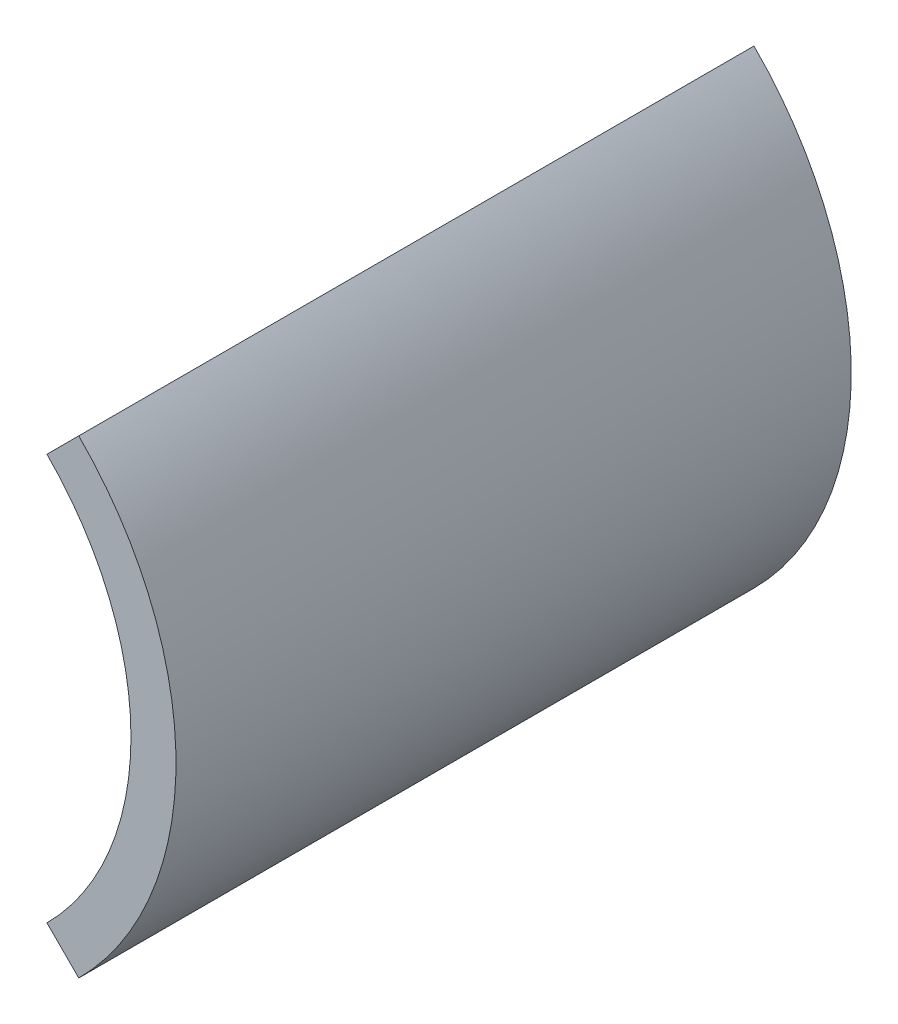
ISO-10303-21;
HEADER;
FILE_DESCRIPTION(('STEP AP214'),'2;1');
FILE_NAME('part.step','',(''),(''),'','','');
FILE_SCHEMA(('AUTOMOTIVE_DESIGN { 1 0 10303 214 1 1 1 1 }'));
ENDSEC;
DATA;
#1=APPLICATION_CONTEXT('core data for automotive mechanical design processes');
#2=APPLICATION_PROTOCOL_DEFINITION('international standard','automotive_design',2000,#1);
#3=PRODUCT_CONTEXT('',#1,'mechanical');
#4=PRODUCT('Part','Part','',(#3));
#5=PRODUCT_RELATED_PRODUCT_CATEGORY('part','',(#4));
#6=PRODUCT_DEFINITION_FORMATION('','',#4);
#7=PRODUCT_DEFINITION_CONTEXT('part definition',#1,'design');
#8=PRODUCT_DEFINITION('design','',#6,#7);
#9=PRODUCT_DEFINITION_SHAPE('','',#8);
#10=(LENGTH_UNIT() NAMED_UNIT(*) SI_UNIT(.MILLI.,.METRE.));
#11=(NAMED_UNIT(*) PLANE_ANGLE_UNIT() SI_UNIT($,.RADIAN.));
#12=(NAMED_UNIT(*) SI_UNIT($,.STERADIAN.) SOLID_ANGLE_UNIT());
#13=UNCERTAINTY_MEASURE_WITH_UNIT(LENGTH_MEASURE(1.E-05),#10,'distance_accuracy_value','');
#14=(GEOMETRIC_REPRESENTATION_CONTEXT(3) GLOBAL_UNCERTAINTY_ASSIGNED_CONTEXT((#13)) GLOBAL_UNIT_ASSIGNED_CONTEXT((#10,
#11,#12)) REPRESENTATION_CONTEXT('',''));
#15=CARTESIAN_POINT('',(0.,0.,0.));
#16=DIRECTION('',(0.,0.,1.));
#17=DIRECTION('',(1.,0.,0.));
#18=AXIS2_PLACEMENT_3D('',#15,#16,#17);
#19=CARTESIAN_POINT('',(0.,0.,15.));
#20=DIRECTION('',(0.,0.,-1.));
#21=DIRECTION('',(-1.,0.,0.));
#22=AXIS2_PLACEMENT_3D('',#19,#20,#21);
#23=CYLINDRICAL_SURFACE('',#22,12.75);
#24=CARTESIAN_POINT('',(0.,0.,-15.));
#25=DIRECTION('',(0.,0.,-1.));
#26=DIRECTION('',(1.,0.,0.));
#27=AXIS2_PLACEMENT_3D('',#24,#25,#26);
#28=CIRCLE('',#27,12.75);
#29=CARTESIAN_POINT('',(9.01561146012846,9.0156114601285,-15.));
#30=VERTEX_POINT('',#29);
#31=CARTESIAN_POINT('',(9.01561146012846,-9.0156114601285,-15.));
#32=VERTEX_POINT('',#31);
#33=EDGE_CURVE('E100',#30,#32,#28,.T.);
#34=ORIENTED_EDGE('',*,*,#33,.T.);
#35=DIRECTION('',(0.,0.,-1.));
#36=VECTOR('',#35,1.);
#37=CARTESIAN_POINT('',(9.01561146012846,-9.0156114601285,15.));
#38=LINE('',#37,#36);
#39=CARTESIAN_POINT('',(9.01561146012846,-9.0156114601285,15.));
#40=VERTEX_POINT('',#39);
#41=EDGE_CURVE('E11',#40,#32,#38,.T.);
#42=ORIENTED_EDGE('',*,*,#41,.F.);
#43=CARTESIAN_POINT('',(0.,0.,15.));
#44=DIRECTION('',(0.,0.,-1.));
#45=DIRECTION('',(1.,0.,0.));
#46=AXIS2_PLACEMENT_3D('',#43,#44,#45);
#47=CIRCLE('',#46,12.75);
#48=CARTESIAN_POINT('',(9.01561146012846,9.0156114601285,15.));
#49=VERTEX_POINT('',#48);
#50=EDGE_CURVE('E88',#49,#40,#47,.T.);
#51=ORIENTED_EDGE('',*,*,#50,.F.);
#52=DIRECTION('',(0.,0.,-1.));
#53=VECTOR('',#52,1.);
#54=CARTESIAN_POINT('',(9.01561146012846,9.0156114601285,15.));
#55=LINE('',#54,#53);
#56=EDGE_CURVE('E96',#49,#30,#55,.T.);
#57=ORIENTED_EDGE('',*,*,#56,.T.);
#58=EDGE_LOOP('',(#34,#42,#51,#57));
#59=FACE_BOUND('',#58,.T.);
#60=ADVANCED_FACE('F37',(#59),#23,.F.);
#61=CARTESIAN_POINT('',(9.01561146012846,-9.0156114601285,15.));
#62=DIRECTION('',(0.707106781186549,0.707106781186546,0.));
#63=DIRECTION('',(-0.707106781186546,0.707106781186549,0.));
#64=AXIS2_PLACEMENT_3D('',#61,#62,#63);
#65=PLANE('',#64);
#66=DIRECTION('',(0.707106781186546,-0.707106781186549,0.));
#67=VECTOR('',#66,1.);
#68=CARTESIAN_POINT('',(9.01561146012846,-9.0156114601285,-15.));
#69=LINE('',#68,#67);
#70=CARTESIAN_POINT('',(10.4298250225016,-10.4298250225016,-15.));
#71=VERTEX_POINT('',#70);
#72=EDGE_CURVE('E92',#32,#71,#69,.T.);
#73=ORIENTED_EDGE('',*,*,#72,.T.);
#74=DIRECTION('',(0.,0.,-1.));
#75=VECTOR('',#74,1.);
#76=CARTESIAN_POINT('',(10.4298250225016,-10.4298250225016,15.));
#77=LINE('',#76,#75);
#78=CARTESIAN_POINT('',(10.4298250225016,-10.4298250225016,15.));
#79=VERTEX_POINT('',#78);
#80=EDGE_CURVE('E45',#79,#71,#77,.T.);
#81=ORIENTED_EDGE('',*,*,#80,.F.);
#82=DIRECTION('',(0.707106781186546,-0.707106781186549,0.));
#83=VECTOR('',#82,1.);
#84=CARTESIAN_POINT('',(9.01561146012846,-9.0156114601285,15.));
#85=LINE('',#84,#83);
#86=EDGE_CURVE('E83',#40,#79,#85,.T.);
#87=ORIENTED_EDGE('',*,*,#86,.F.);
#88=ORIENTED_EDGE('',*,*,#41,.T.);
#89=EDGE_LOOP('',(#73,#81,#87,#88));
#90=FACE_BOUND('',#89,.T.);
#91=ADVANCED_FACE('F91',(#90),#65,.F.);
#92=CARTESIAN_POINT('',(0.,0.,15.));
#93=DIRECTION('',(0.,0.,-1.));
#94=DIRECTION('',(-1.,0.,0.));
#95=AXIS2_PLACEMENT_3D('',#92,#93,#94);
#96=CYLINDRICAL_SURFACE('',#95,14.75);
#97=CARTESIAN_POINT('',(0.,0.,-15.));
#98=DIRECTION('',(0.,0.,1.));
#99=DIRECTION('',(1.,0.,0.));
#100=AXIS2_PLACEMENT_3D('',#97,#98,#99);
#101=CIRCLE('',#100,14.75);
#102=CARTESIAN_POINT('',(10.4298250225016,10.4298250225016,-15.));
#103=VERTEX_POINT('',#102);
#104=EDGE_CURVE('E70',#71,#103,#101,.T.);
#105=ORIENTED_EDGE('',*,*,#104,.T.);
#106=DIRECTION('',(0.,0.,-1.));
#107=VECTOR('',#106,1.);
#108=CARTESIAN_POINT('',(10.4298250225016,10.4298250225016,15.));
#109=LINE('',#108,#107);
#110=CARTESIAN_POINT('',(10.4298250225016,10.4298250225016,15.));
#111=VERTEX_POINT('',#110);
#112=EDGE_CURVE('E93',#111,#103,#109,.T.);
#113=ORIENTED_EDGE('',*,*,#112,.F.);
#114=CARTESIAN_POINT('',(0.,0.,15.));
#115=DIRECTION('',(0.,0.,1.));
#116=DIRECTION('',(1.,0.,0.));
#117=AXIS2_PLACEMENT_3D('',#114,#115,#116);
#118=CIRCLE('',#117,14.75);
#119=EDGE_CURVE('E86',#79,#111,#118,.T.);
#120=ORIENTED_EDGE('',*,*,#119,.F.);
#121=ORIENTED_EDGE('',*,*,#80,.T.);
#122=EDGE_LOOP('',(#105,#113,#120,#121));
#123=FACE_BOUND('',#122,.T.);
#124=ADVANCED_FACE('F94',(#123),#96,.T.);
#125=CARTESIAN_POINT('',(9.01561146012846,9.0156114601285,15.));
#126=DIRECTION('',(0.707106781186549,-0.707106781186546,0.));
#127=DIRECTION('',(0.707106781186546,0.707106781186549,0.));
#128=AXIS2_PLACEMENT_3D('',#125,#126,#127);
#129=PLANE('',#128);
#130=DIRECTION('',(-0.707106781186546,-0.707106781186549,0.));
#131=VECTOR('',#130,1.);
#132=CARTESIAN_POINT('',(9.01561146012846,9.0156114601285,-15.));
#133=LINE('',#132,#131);
#134=EDGE_CURVE('E76',#103,#30,#133,.T.);
#135=ORIENTED_EDGE('',*,*,#134,.T.);
#136=ORIENTED_EDGE('',*,*,#56,.F.);
#137=DIRECTION('',(-0.707106781186546,-0.707106781186549,0.));
#138=VECTOR('',#137,1.);
#139=CARTESIAN_POINT('',(9.01561146012846,9.0156114601285,15.));
#140=LINE('',#139,#138);
#141=EDGE_CURVE('E53',#111,#49,#140,.T.);
#142=ORIENTED_EDGE('',*,*,#141,.F.);
#143=ORIENTED_EDGE('',*,*,#112,.T.);
#144=EDGE_LOOP('',(#135,#136,#142,#143));
#145=FACE_BOUND('',#144,.T.);
#146=ADVANCED_FACE('F107',(#145),#129,.F.);
#147=CARTESIAN_POINT('',(0.,0.,15.));
#148=DIRECTION('',(0.,0.,1.));
#149=DIRECTION('',(1.,0.,0.));
#150=AXIS2_PLACEMENT_3D('',#147,#148,#149);
#151=PLANE('',#150);
#152=ORIENTED_EDGE('',*,*,#50,.T.);
#153=ORIENTED_EDGE('',*,*,#86,.T.);
#154=ORIENTED_EDGE('',*,*,#119,.T.);
#155=ORIENTED_EDGE('',*,*,#141,.T.);
#156=EDGE_LOOP('',(#152,#153,#154,#155));
#157=FACE_BOUND('',#156,.T.);
#158=ADVANCED_FACE('F84',(#157),#151,.T.);
#159=CARTESIAN_POINT('',(0.,0.,-15.));
#160=DIRECTION('',(0.,0.,1.));
#161=DIRECTION('',(1.,0.,0.));
#162=AXIS2_PLACEMENT_3D('',#159,#160,#161);
#163=PLANE('',#162);
#164=ORIENTED_EDGE('',*,*,#33,.F.);
#165=ORIENTED_EDGE('',*,*,#134,.F.);
#166=ORIENTED_EDGE('',*,*,#104,.F.);
#167=ORIENTED_EDGE('',*,*,#72,.F.);
#168=EDGE_LOOP('',(#164,#165,#166,#167));
#169=FACE_BOUND('',#168,.T.);
#170=ADVANCED_FACE('F110',(#169),#163,.F.);
#171=CLOSED_SHELL('',(#60,#91,#124,#146,#158,#170));
#172=MANIFOLD_SOLID_BREP('B2',#171);
#173=ADVANCED_BREP_SHAPE_REPRESENTATION('',(#18,#172),#14);
#174=SHAPE_DEFINITION_REPRESENTATION(#9,#173);
ENDSEC;
END-ISO-10303-21;
